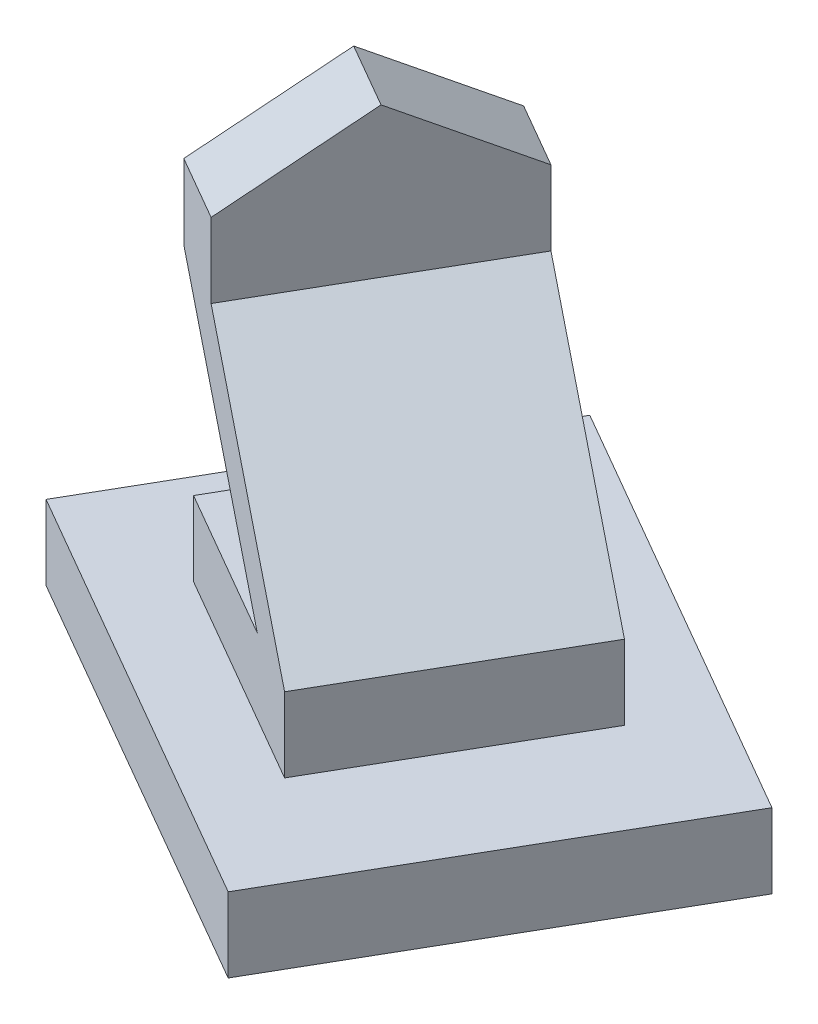
ISO-10303-21;
HEADER;
FILE_DESCRIPTION(('STEP AP214'),'2;1');
FILE_NAME('part.step','',(''),(''),'','','');
FILE_SCHEMA(('AUTOMOTIVE_DESIGN { 1 0 10303 214 1 1 1 1 }'));
ENDSEC;
DATA;
#1=APPLICATION_CONTEXT('core data for automotive mechanical design processes');
#2=APPLICATION_PROTOCOL_DEFINITION('international standard','automotive_design',2000,#1);
#3=PRODUCT_CONTEXT('',#1,'mechanical');
#4=PRODUCT('Part','Part','',(#3));
#5=PRODUCT_RELATED_PRODUCT_CATEGORY('part','',(#4));
#6=PRODUCT_DEFINITION_FORMATION('','',#4);
#7=PRODUCT_DEFINITION_CONTEXT('part definition',#1,'design');
#8=PRODUCT_DEFINITION('design','',#6,#7);
#9=PRODUCT_DEFINITION_SHAPE('','',#8);
#10=(LENGTH_UNIT() NAMED_UNIT(*) SI_UNIT(.MILLI.,.METRE.));
#11=(NAMED_UNIT(*) PLANE_ANGLE_UNIT() SI_UNIT($,.RADIAN.));
#12=(NAMED_UNIT(*) SI_UNIT($,.STERADIAN.) SOLID_ANGLE_UNIT());
#13=UNCERTAINTY_MEASURE_WITH_UNIT(LENGTH_MEASURE(1.E-05),#10,'distance_accuracy_value','');
#14=(GEOMETRIC_REPRESENTATION_CONTEXT(3) GLOBAL_UNCERTAINTY_ASSIGNED_CONTEXT((#13)) GLOBAL_UNIT_ASSIGNED_CONTEXT((#10,
#11,#12)) REPRESENTATION_CONTEXT('',''));
#15=CARTESIAN_POINT('',(0.,0.,0.));
#16=DIRECTION('',(0.,0.,1.));
#17=DIRECTION('',(1.,0.,0.));
#18=AXIS2_PLACEMENT_3D('',#15,#16,#17);
#19=CARTESIAN_POINT('',(-1732.05080756888,300.,-999.999999999994));
#20=DIRECTION('',(0.,-1.,0.));
#21=DIRECTION('',(0.,0.,-1.));
#22=AXIS2_PLACEMENT_3D('',#19,#20,#21);
#23=PLANE('',#22);
#24=DIRECTION('',(0.86602540378444,0.,0.499999999999997));
#25=VECTOR('',#24,1.);
#26=CARTESIAN_POINT('',(-1732.05080756888,300.,-999.999999999994));
#27=LINE('',#26,#25);
#28=CARTESIAN_POINT('',(-1732.05080756888,300.,-999.999999999994));
#29=VERTEX_POINT('',#28);
#30=CARTESIAN_POINT('',(0.,300.,0.));
#31=VERTEX_POINT('',#30);
#32=EDGE_CURVE('E238',#29,#31,#27,.T.);
#33=ORIENTED_EDGE('',*,*,#32,.T.);
#34=DIRECTION('',(0.499999999999998,0.,-0.86602540378444));
#35=VECTOR('',#34,1.);
#36=CARTESIAN_POINT('',(0.,300.,0.));
#37=LINE('',#36,#35);
#38=CARTESIAN_POINT('',(799.999999999996,300.,-1385.6406460551));
#39=VERTEX_POINT('',#38);
#40=EDGE_CURVE('E236',#31,#39,#37,.T.);
#41=ORIENTED_EDGE('',*,*,#40,.T.);
#42=DIRECTION('',(-0.86602540378444,0.,-0.499999999999998));
#43=VECTOR('',#42,1.);
#44=CARTESIAN_POINT('',(799.999999999996,300.,-1385.6406460551));
#45=LINE('',#44,#43);
#46=CARTESIAN_POINT('',(-932.050807568884,300.,-2385.6406460551));
#47=VERTEX_POINT('',#46);
#48=EDGE_CURVE('E234',#39,#47,#45,.T.);
#49=ORIENTED_EDGE('',*,*,#48,.T.);
#50=DIRECTION('',(-0.499999999999997,0.,0.86602540378444));
#51=VECTOR('',#50,1.);
#52=CARTESIAN_POINT('',(-932.050807568884,300.,-2385.6406460551));
#53=LINE('',#52,#51);
#54=EDGE_CURVE('E232',#47,#29,#53,.T.);
#55=ORIENTED_EDGE('',*,*,#54,.T.);
#56=EDGE_LOOP('',(#33,#41,#49,#55));
#57=FACE_BOUND('',#56,.T.);
#58=DIRECTION('',(-0.5,0.,0.866025403784439));
#59=VECTOR('',#58,1.);
#60=CARTESIAN_POINT('',(-1149.03810567667,300.,-1009.80762113533));
#61=LINE('',#60,#59);
#62=CARTESIAN_POINT('',(-649.038105676662,300.,-1875.83302491977));
#63=VERTEX_POINT('',#62);
#64=CARTESIAN_POINT('',(-1149.03810567667,300.,-1009.80762113533));
#65=VERTEX_POINT('',#64);
#66=EDGE_CURVE('E193',#63,#65,#61,.T.);
#67=ORIENTED_EDGE('',*,*,#66,.F.);
#68=DIRECTION('',(-0.866025403784439,0.,-0.499999999999999));
#69=VECTOR('',#68,1.);
#70=CARTESIAN_POINT('',(-649.038105676662,300.,-1875.83302491977));
#71=LINE('',#70,#69);
#72=CARTESIAN_POINT('',(216.987298107781,300.,-1375.83302491977));
#73=VERTEX_POINT('',#72);
#74=EDGE_CURVE('E213',#73,#63,#71,.T.);
#75=ORIENTED_EDGE('',*,*,#74,.F.);
#76=DIRECTION('',(0.499999999999999,0.,-0.866025403784439));
#77=VECTOR('',#76,1.);
#78=CARTESIAN_POINT('',(216.987298107781,300.,-1375.83302491977));
#79=LINE('',#78,#77);
#80=CARTESIAN_POINT('',(-283.012701892222,300.,-509.807621135326));
#81=VERTEX_POINT('',#80);
#82=EDGE_CURVE('E210',#81,#73,#79,.T.);
#83=ORIENTED_EDGE('',*,*,#82,.F.);
#84=DIRECTION('',(0.866025403784439,0.,0.5));
#85=VECTOR('',#84,1.);
#86=CARTESIAN_POINT('',(-283.012701892222,300.,-509.807621135326));
#87=LINE('',#86,#85);
#88=EDGE_CURVE('E59',#65,#81,#87,.T.);
#89=ORIENTED_EDGE('',*,*,#88,.F.);
#90=EDGE_LOOP('',(#67,#75,#83,#89));
#91=FACE_BOUND('',#90,.T.);
#92=ADVANCED_FACE('F34',(#57,#91),#23,.F.);
#93=CARTESIAN_POINT('',(-1732.05080756888,300.,-999.999999999994));
#94=DIRECTION('',(0.499999999999997,0.,-0.86602540378444));
#95=DIRECTION('',(-0.86602540378444,0.,-0.499999999999997));
#96=AXIS2_PLACEMENT_3D('',#93,#94,#95);
#97=PLANE('',#96);
#98=DIRECTION('',(0.86602540378444,0.,0.499999999999997));
#99=VECTOR('',#98,1.);
#100=CARTESIAN_POINT('',(-1732.05080756888,0.,-999.999999999994));
#101=LINE('',#100,#99);
#102=CARTESIAN_POINT('',(-1732.05080756888,0.,-999.999999999994));
#103=VERTEX_POINT('',#102);
#104=CARTESIAN_POINT('',(0.,0.,0.));
#105=VERTEX_POINT('',#104);
#106=EDGE_CURVE('E247',#103,#105,#101,.T.);
#107=ORIENTED_EDGE('',*,*,#106,.T.);
#108=DIRECTION('',(0.,-1.,0.));
#109=VECTOR('',#108,1.);
#110=CARTESIAN_POINT('',(0.,300.,0.));
#111=LINE('',#110,#109);
#112=EDGE_CURVE('E11',#31,#105,#111,.T.);
#113=ORIENTED_EDGE('',*,*,#112,.F.);
#114=ORIENTED_EDGE('',*,*,#32,.F.);
#115=DIRECTION('',(0.,-1.,0.));
#116=VECTOR('',#115,1.);
#117=CARTESIAN_POINT('',(-1732.05080756888,300.,-999.999999999994));
#118=LINE('',#117,#116);
#119=EDGE_CURVE('E229',#29,#103,#118,.T.);
#120=ORIENTED_EDGE('',*,*,#119,.T.);
#121=EDGE_LOOP('',(#107,#113,#114,#120));
#122=FACE_BOUND('',#121,.T.);
#123=ADVANCED_FACE('F36',(#122),#97,.F.);
#124=CARTESIAN_POINT('',(0.,300.,0.));
#125=DIRECTION('',(-0.86602540378444,0.,-0.499999999999998));
#126=DIRECTION('',(-0.499999999999998,0.,0.86602540378444));
#127=AXIS2_PLACEMENT_3D('',#124,#125,#126);
#128=PLANE('',#127);
#129=DIRECTION('',(0.499999999999998,0.,-0.86602540378444));
#130=VECTOR('',#129,1.);
#131=CARTESIAN_POINT('',(0.,0.,0.));
#132=LINE('',#131,#130);
#133=CARTESIAN_POINT('',(799.999999999996,0.,-1385.6406460551));
#134=VERTEX_POINT('',#133);
#135=EDGE_CURVE('E245',#105,#134,#132,.T.);
#136=ORIENTED_EDGE('',*,*,#135,.T.);
#137=DIRECTION('',(0.,-1.,0.));
#138=VECTOR('',#137,1.);
#139=CARTESIAN_POINT('',(799.999999999996,300.,-1385.6406460551));
#140=LINE('',#139,#138);
#141=EDGE_CURVE('E43',#39,#134,#140,.T.);
#142=ORIENTED_EDGE('',*,*,#141,.F.);
#143=ORIENTED_EDGE('',*,*,#40,.F.);
#144=ORIENTED_EDGE('',*,*,#112,.T.);
#145=EDGE_LOOP('',(#136,#142,#143,#144));
#146=FACE_BOUND('',#145,.T.);
#147=ADVANCED_FACE('F294',(#146),#128,.F.);
#148=CARTESIAN_POINT('',(799.999999999996,300.,-1385.6406460551));
#149=DIRECTION('',(-0.499999999999998,0.,0.86602540378444));
#150=DIRECTION('',(0.86602540378444,0.,0.499999999999998));
#151=AXIS2_PLACEMENT_3D('',#148,#149,#150);
#152=PLANE('',#151);
#153=DIRECTION('',(-0.86602540378444,0.,-0.499999999999998));
#154=VECTOR('',#153,1.);
#155=CARTESIAN_POINT('',(799.999999999996,0.,-1385.6406460551));
#156=LINE('',#155,#154);
#157=CARTESIAN_POINT('',(-932.050807568884,0.,-2385.6406460551));
#158=VERTEX_POINT('',#157);
#159=EDGE_CURVE('E243',#134,#158,#156,.T.);
#160=ORIENTED_EDGE('',*,*,#159,.T.);
#161=DIRECTION('',(0.,-1.,0.));
#162=VECTOR('',#161,1.);
#163=CARTESIAN_POINT('',(-932.050807568884,300.,-2385.6406460551));
#164=LINE('',#163,#162);
#165=EDGE_CURVE('E226',#47,#158,#164,.T.);
#166=ORIENTED_EDGE('',*,*,#165,.F.);
#167=ORIENTED_EDGE('',*,*,#48,.F.);
#168=ORIENTED_EDGE('',*,*,#141,.T.);
#169=EDGE_LOOP('',(#160,#166,#167,#168));
#170=FACE_BOUND('',#169,.T.);
#171=ADVANCED_FACE('F303',(#170),#152,.F.);
#172=CARTESIAN_POINT('',(-932.050807568884,300.,-2385.6406460551));
#173=DIRECTION('',(0.86602540378444,0.,0.499999999999997));
#174=DIRECTION('',(0.499999999999997,0.,-0.86602540378444));
#175=AXIS2_PLACEMENT_3D('',#172,#173,#174);
#176=PLANE('',#175);
#177=DIRECTION('',(-0.499999999999997,0.,0.86602540378444));
#178=VECTOR('',#177,1.);
#179=CARTESIAN_POINT('',(-932.050807568884,0.,-2385.6406460551));
#180=LINE('',#179,#178);
#181=EDGE_CURVE('E241',#158,#103,#180,.T.);
#182=ORIENTED_EDGE('',*,*,#181,.T.);
#183=ORIENTED_EDGE('',*,*,#119,.F.);
#184=ORIENTED_EDGE('',*,*,#54,.F.);
#185=ORIENTED_EDGE('',*,*,#165,.T.);
#186=EDGE_LOOP('',(#182,#183,#184,#185));
#187=FACE_BOUND('',#186,.T.);
#188=ADVANCED_FACE('F300',(#187),#176,.F.);
#189=CARTESIAN_POINT('',(-1732.05080756888,0.,-999.999999999994));
#190=DIRECTION('',(0.,-1.,0.));
#191=DIRECTION('',(0.,0.,-1.));
#192=AXIS2_PLACEMENT_3D('',#189,#190,#191);
#193=PLANE('',#192);
#194=ORIENTED_EDGE('',*,*,#106,.F.);
#195=ORIENTED_EDGE('',*,*,#181,.F.);
#196=ORIENTED_EDGE('',*,*,#159,.F.);
#197=ORIENTED_EDGE('',*,*,#135,.F.);
#198=EDGE_LOOP('',(#194,#195,#196,#197));
#199=FACE_BOUND('',#198,.T.);
#200=ADVANCED_FACE('F298',(#199),#193,.T.);
#201=CARTESIAN_POINT('',(-1149.03810567667,600.,-1009.80762113533));
#202=DIRECTION('',(0.866025403784439,0.,0.5));
#203=DIRECTION('',(0.5,0.,-0.866025403784439));
#204=AXIS2_PLACEMENT_3D('',#201,#202,#203);
#205=PLANE('',#204);
#206=ORIENTED_EDGE('',*,*,#66,.T.);
#207=DIRECTION('',(0.,-1.,0.));
#208=VECTOR('',#207,1.);
#209=CARTESIAN_POINT('',(-1149.03810567667,600.,-1009.80762113533));
#210=LINE('',#209,#208);
#211=CARTESIAN_POINT('',(-1149.03810567667,600.,-1009.80762113533));
#212=VERTEX_POINT('',#211);
#213=EDGE_CURVE('E250',#212,#65,#210,.T.);
#214=ORIENTED_EDGE('',*,*,#213,.F.);
#215=DIRECTION('',(-0.5,0.,0.866025403784439));
#216=VECTOR('',#215,1.);
#217=CARTESIAN_POINT('',(-1149.03810567667,600.,-1009.80762113533));
#218=LINE('',#217,#216);
#219=CARTESIAN_POINT('',(-649.038105676662,600.,-1875.83302491977));
#220=VERTEX_POINT('',#219);
#221=EDGE_CURVE('E216',#220,#212,#218,.T.);
#222=ORIENTED_EDGE('',*,*,#221,.F.);
#223=DIRECTION('',(0.,-1.,0.));
#224=VECTOR('',#223,1.);
#225=CARTESIAN_POINT('',(-649.038105676662,600.,-1875.83302491977));
#226=LINE('',#225,#224);
#227=EDGE_CURVE('E258',#220,#63,#226,.T.);
#228=ORIENTED_EDGE('',*,*,#227,.T.);
#229=EDGE_LOOP('',(#206,#214,#222,#228));
#230=FACE_BOUND('',#229,.T.);
#231=ADVANCED_FACE('F323',(#230),#205,.F.);
#232=CARTESIAN_POINT('',(-283.012701892222,600.,-509.807621135326));
#233=DIRECTION('',(0.5,0.,-0.866025403784439));
#234=DIRECTION('',(-0.866025403784439,0.,-0.5));
#235=AXIS2_PLACEMENT_3D('',#232,#233,#234);
#236=PLANE('',#235);
#237=ORIENTED_EDGE('',*,*,#88,.T.);
#238=DIRECTION('',(0.,-1.,0.));
#239=VECTOR('',#238,1.);
#240=CARTESIAN_POINT('',(-283.012701892222,600.,-509.807621135326));
#241=LINE('',#240,#239);
#242=CARTESIAN_POINT('',(-283.012701892222,600.,-509.807621135326));
#243=VERTEX_POINT('',#242);
#244=EDGE_CURVE('E252',#243,#81,#241,.T.);
#245=ORIENTED_EDGE('',*,*,#244,.F.);
#246=DIRECTION('',(-0.615137367081816,0.703899632636785,-0.355149724473284));
#247=VECTOR('',#246,1.);
#248=CARTESIAN_POINT('',(-283.012701892222,600.,-509.807621135326));
#249=LINE('',#248,#247);
#250=CARTESIAN_POINT('',(-982.132108762809,1400.,-913.44439888775));
#251=VERTEX_POINT('',#250);
#252=EDGE_CURVE('E148',#243,#251,#249,.T.);
#253=ORIENTED_EDGE('',*,*,#252,.T.);
#254=DIRECTION('',(0.,1.,0.));
#255=VECTOR('',#254,1.);
#256=CARTESIAN_POINT('',(-982.132108762809,1400.,-913.44439888775));
#257=LINE('',#256,#255);
#258=CARTESIAN_POINT('',(-982.132108762809,1700.,-913.44439888775));
#259=VERTEX_POINT('',#258);
#260=EDGE_CURVE('E169',#251,#259,#257,.T.);
#261=ORIENTED_EDGE('',*,*,#260,.T.);
#262=DIRECTION('',(-0.866025403784439,0.,-0.499999999999999));
#263=VECTOR('',#262,1.);
#264=CARTESIAN_POINT('',(-982.132108762809,1700.,-913.44439888775));
#265=LINE('',#264,#263);
#266=CARTESIAN_POINT('',(-1241.93972989814,1700.,-1063.44439888775));
#267=VERTEX_POINT('',#266);
#268=EDGE_CURVE('E154',#259,#267,#265,.T.);
#269=ORIENTED_EDGE('',*,*,#268,.T.);
#270=DIRECTION('',(0.,-1.,0.));
#271=VECTOR('',#270,1.);
#272=CARTESIAN_POINT('',(-1241.93972989814,1700.,-1063.44439888775));
#273=LINE('',#272,#271);
#274=CARTESIAN_POINT('',(-1241.93972989814,1400.,-1063.44439888775));
#275=VERTEX_POINT('',#274);
#276=EDGE_CURVE('E172',#267,#275,#273,.T.);
#277=ORIENTED_EDGE('',*,*,#276,.T.);
#278=DIRECTION('',(0.615137367081816,-0.703899632636785,0.355149724473284));
#279=VECTOR('',#278,1.);
#280=CARTESIAN_POINT('',(-1241.93972989814,1400.,-1063.44439888775));
#281=LINE('',#280,#279);
#282=CARTESIAN_POINT('',(-542.820323027554,600.,-659.807621135326));
#283=VERTEX_POINT('',#282);
#284=EDGE_CURVE('E175',#275,#283,#281,.T.);
#285=ORIENTED_EDGE('',*,*,#284,.T.);
#286=DIRECTION('',(0.866025403784439,0.,0.5));
#287=VECTOR('',#286,1.);
#288=CARTESIAN_POINT('',(-283.012701892222,600.,-509.807621135326));
#289=LINE('',#288,#287);
#290=EDGE_CURVE('E219',#212,#283,#289,.T.);
#291=ORIENTED_EDGE('',*,*,#290,.F.);
#292=ORIENTED_EDGE('',*,*,#213,.T.);
#293=EDGE_LOOP('',(#237,#245,#253,#261,#269,#277,#285,#291,#292));
#294=FACE_BOUND('',#293,.T.);
#295=ADVANCED_FACE('F276',(#294),#236,.F.);
#296=CARTESIAN_POINT('',(216.987298107781,600.,-1375.83302491977));
#297=DIRECTION('',(-0.866025403784439,0.,-0.499999999999999));
#298=DIRECTION('',(-0.499999999999999,0.,0.866025403784439));
#299=AXIS2_PLACEMENT_3D('',#296,#297,#298);
#300=PLANE('',#299);
#301=ORIENTED_EDGE('',*,*,#82,.T.);
#302=DIRECTION('',(0.,-1.,0.));
#303=VECTOR('',#302,1.);
#304=CARTESIAN_POINT('',(216.987298107781,600.,-1375.83302491977));
#305=LINE('',#304,#303);
#306=CARTESIAN_POINT('',(216.987298107781,600.,-1375.83302491977));
#307=VERTEX_POINT('',#306);
#308=EDGE_CURVE('E255',#307,#73,#305,.T.);
#309=ORIENTED_EDGE('',*,*,#308,.F.);
#310=DIRECTION('',(0.499999999999999,0.,-0.866025403784439));
#311=VECTOR('',#310,1.);
#312=CARTESIAN_POINT('',(216.987298107781,600.,-1375.83302491977));
#313=LINE('',#312,#311);
#314=EDGE_CURVE('E222',#243,#307,#313,.T.);
#315=ORIENTED_EDGE('',*,*,#314,.F.);
#316=ORIENTED_EDGE('',*,*,#244,.T.);
#317=EDGE_LOOP('',(#301,#309,#315,#316));
#318=FACE_BOUND('',#317,.T.);
#319=ADVANCED_FACE('F330',(#318),#300,.F.);
#320=CARTESIAN_POINT('',(-649.038105676662,600.,-1875.83302491977));
#321=DIRECTION('',(-0.499999999999999,0.,0.866025403784439));
#322=DIRECTION('',(0.866025403784439,0.,0.499999999999999));
#323=AXIS2_PLACEMENT_3D('',#320,#321,#322);
#324=PLANE('',#323);
#325=ORIENTED_EDGE('',*,*,#74,.T.);
#326=ORIENTED_EDGE('',*,*,#227,.F.);
#327=DIRECTION('',(-0.866025403784439,0.,-0.499999999999999));
#328=VECTOR('',#327,1.);
#329=CARTESIAN_POINT('',(-649.038105676662,600.,-1875.83302491977));
#330=LINE('',#329,#328);
#331=CARTESIAN_POINT('',(-42.8203230275505,600.,-1525.83302491977));
#332=VERTEX_POINT('',#331);
#333=EDGE_CURVE('E194',#332,#220,#330,.T.);
#334=ORIENTED_EDGE('',*,*,#333,.F.);
#335=DIRECTION('',(0.615137367081816,-0.703899632636785,0.355149724473284));
#336=VECTOR('',#335,1.);
#337=CARTESIAN_POINT('',(-741.939729898141,1400.,-1929.46980267219));
#338=LINE('',#337,#336);
#339=CARTESIAN_POINT('',(-741.939729898141,1400.,-1929.46980267219));
#340=VERTEX_POINT('',#339);
#341=EDGE_CURVE('E185',#340,#332,#338,.T.);
#342=ORIENTED_EDGE('',*,*,#341,.F.);
#343=DIRECTION('',(0.,-1.,0.));
#344=VECTOR('',#343,1.);
#345=CARTESIAN_POINT('',(-741.939729898141,1700.,-1929.46980267219));
#346=LINE('',#345,#344);
#347=CARTESIAN_POINT('',(-741.939729898141,1700.,-1929.46980267219));
#348=VERTEX_POINT('',#347);
#349=EDGE_CURVE('E182',#348,#340,#346,.T.);
#350=ORIENTED_EDGE('',*,*,#349,.F.);
#351=DIRECTION('',(-0.866025403784439,0.,-0.499999999999999));
#352=VECTOR('',#351,1.);
#353=CARTESIAN_POINT('',(-482.132108762809,1700.,-1779.46980267219));
#354=LINE('',#353,#352);
#355=CARTESIAN_POINT('',(-482.132108762809,1700.,-1779.46980267219));
#356=VERTEX_POINT('',#355);
#357=EDGE_CURVE('E180',#356,#348,#354,.T.);
#358=ORIENTED_EDGE('',*,*,#357,.F.);
#359=DIRECTION('',(0.,1.,0.));
#360=VECTOR('',#359,1.);
#361=CARTESIAN_POINT('',(-482.132108762809,1400.,-1779.46980267219));
#362=LINE('',#361,#360);
#363=CARTESIAN_POINT('',(-482.132108762809,1400.,-1779.46980267219));
#364=VERTEX_POINT('',#363);
#365=EDGE_CURVE('E161',#364,#356,#362,.T.);
#366=ORIENTED_EDGE('',*,*,#365,.F.);
#367=DIRECTION('',(-0.615137367081816,0.703899632636785,-0.355149724473284));
#368=VECTOR('',#367,1.);
#369=CARTESIAN_POINT('',(216.987298107778,600.,-1375.83302491976));
#370=LINE('',#369,#368);
#371=EDGE_CURVE('E176',#307,#364,#370,.T.);
#372=ORIENTED_EDGE('',*,*,#371,.F.);
#373=ORIENTED_EDGE('',*,*,#308,.T.);
#374=EDGE_LOOP('',(#325,#326,#334,#342,#350,#358,#366,#372,#373));
#375=FACE_BOUND('',#374,.T.);
#376=ADVANCED_FACE('F270',(#375),#324,.F.);
#377=CARTESIAN_POINT('',(-1149.03810567667,600.,-1009.80762113533));
#378=DIRECTION('',(0.,1.,0.));
#379=DIRECTION('',(0.,0.,1.));
#380=AXIS2_PLACEMENT_3D('',#377,#378,#379);
#381=PLANE('',#380);
#382=DIRECTION('',(-0.5,0.,0.866025403784439));
#383=VECTOR('',#382,1.);
#384=CARTESIAN_POINT('',(-42.8203230275537,600.,-1525.83302491976));
#385=LINE('',#384,#383);
#386=EDGE_CURVE('E51',#332,#283,#385,.T.);
#387=ORIENTED_EDGE('',*,*,#386,.F.);
#388=ORIENTED_EDGE('',*,*,#333,.T.);
#389=ORIENTED_EDGE('',*,*,#221,.T.);
#390=ORIENTED_EDGE('',*,*,#290,.T.);
#391=EDGE_LOOP('',(#387,#388,#389,#390));
#392=FACE_BOUND('',#391,.T.);
#393=ADVANCED_FACE('F279',(#392),#381,.T.);
#394=CARTESIAN_POINT('',(-741.939729898141,1400.,-1929.46980267219));
#395=DIRECTION('',(-0.60959496357799,-0.710299448946569,-0.351949816318392));
#396=DIRECTION('',(0.758851633213317,-0.651263540181302,0.));
#397=AXIS2_PLACEMENT_3D('',#394,#395,#396);
#398=PLANE('',#397);
#399=ORIENTED_EDGE('',*,*,#284,.F.);
#400=DIRECTION('',(-0.5,0.,0.866025403784439));
#401=VECTOR('',#400,1.);
#402=CARTESIAN_POINT('',(-741.939729898141,1400.,-1929.46980267219));
#403=LINE('',#402,#401);
#404=EDGE_CURVE('E188',#340,#275,#403,.T.);
#405=ORIENTED_EDGE('',*,*,#404,.F.);
#406=ORIENTED_EDGE('',*,*,#341,.T.);
#407=ORIENTED_EDGE('',*,*,#386,.T.);
#408=EDGE_LOOP('',(#399,#405,#406,#407));
#409=FACE_BOUND('',#408,.T.);
#410=ADVANCED_FACE('F277',(#409),#398,.T.);
#411=CARTESIAN_POINT('',(-741.939729898141,1700.,-1929.46980267219));
#412=DIRECTION('',(-0.866025403784439,0.,-0.5));
#413=DIRECTION('',(-0.5,0.,0.866025403784439));
#414=AXIS2_PLACEMENT_3D('',#411,#412,#413);
#415=PLANE('',#414);
#416=ORIENTED_EDGE('',*,*,#276,.F.);
#417=DIRECTION('',(-0.428746462856272,-0.514495755427526,0.742610657232506));
#418=VECTOR('',#417,1.);
#419=CARTESIAN_POINT('',(-991.93972989814,2000.,-1496.45710077997));
#420=LINE('',#419,#418);
#421=CARTESIAN_POINT('',(-991.93972989814,2000.,-1496.45710077997));
#422=VERTEX_POINT('',#421);
#423=EDGE_CURVE('E162',#422,#267,#420,.T.);
#424=ORIENTED_EDGE('',*,*,#423,.F.);
#425=DIRECTION('',(-0.428746462856272,0.514495755427526,0.742610657232506));
#426=VECTOR('',#425,1.);
#427=CARTESIAN_POINT('',(-741.939729898141,1700.,-1929.46980267219));
#428=LINE('',#427,#426);
#429=EDGE_CURVE('E144',#348,#422,#428,.T.);
#430=ORIENTED_EDGE('',*,*,#429,.F.);
#431=ORIENTED_EDGE('',*,*,#349,.T.);
#432=ORIENTED_EDGE('',*,*,#404,.T.);
#433=EDGE_LOOP('',(#416,#424,#430,#431,#432));
#434=FACE_BOUND('',#433,.T.);
#435=ADVANCED_FACE('F273',(#434),#415,.T.);
#436=CARTESIAN_POINT('',(-482.132108762809,1400.,-1779.46980267219));
#437=DIRECTION('',(0.866025403784439,0.,0.5));
#438=DIRECTION('',(0.5,0.,-0.866025403784439));
#439=AXIS2_PLACEMENT_3D('',#436,#437,#438);
#440=PLANE('',#439);
#441=ORIENTED_EDGE('',*,*,#260,.F.);
#442=DIRECTION('',(-0.5,0.,0.866025403784439));
#443=VECTOR('',#442,1.);
#444=CARTESIAN_POINT('',(-482.132108762809,1400.,-1779.46980267219));
#445=LINE('',#444,#443);
#446=EDGE_CURVE('E201',#364,#251,#445,.T.);
#447=ORIENTED_EDGE('',*,*,#446,.F.);
#448=ORIENTED_EDGE('',*,*,#365,.T.);
#449=DIRECTION('',(-0.428746462856272,0.514495755427526,0.742610657232506));
#450=VECTOR('',#449,1.);
#451=CARTESIAN_POINT('',(-482.132108762809,1700.,-1779.46980267219));
#452=LINE('',#451,#450);
#453=CARTESIAN_POINT('',(-732.132108762809,2000.,-1346.45710077997));
#454=VERTEX_POINT('',#453);
#455=EDGE_CURVE('E142',#356,#454,#452,.T.);
#456=ORIENTED_EDGE('',*,*,#455,.T.);
#457=DIRECTION('',(-0.428746462856272,-0.514495755427526,0.742610657232506));
#458=VECTOR('',#457,1.);
#459=CARTESIAN_POINT('',(-732.132108762809,2000.,-1346.45710077997));
#460=LINE('',#459,#458);
#461=EDGE_CURVE('E152',#454,#259,#460,.T.);
#462=ORIENTED_EDGE('',*,*,#461,.T.);
#463=EDGE_LOOP('',(#441,#447,#448,#456,#462));
#464=FACE_BOUND('',#463,.T.);
#465=ADVANCED_FACE('F159',(#464),#440,.T.);
#466=CARTESIAN_POINT('',(216.987298107778,600.,-1375.83302491976));
#467=DIRECTION('',(0.60959496357799,0.710299448946569,0.351949816318392));
#468=DIRECTION('',(-0.758851633213317,0.651263540181301,0.));
#469=AXIS2_PLACEMENT_3D('',#466,#467,#468);
#470=PLANE('',#469);
#471=ORIENTED_EDGE('',*,*,#252,.F.);
#472=ORIENTED_EDGE('',*,*,#314,.T.);
#473=ORIENTED_EDGE('',*,*,#371,.T.);
#474=ORIENTED_EDGE('',*,*,#446,.T.);
#475=EDGE_LOOP('',(#471,#472,#473,#474));
#476=FACE_BOUND('',#475,.T.);
#477=ADVANCED_FACE('F267',(#476),#470,.T.);
#478=CARTESIAN_POINT('',(-991.93972989814,2000.,-1496.45710077997));
#479=DIRECTION('',(-0.257247877713763,0.857492925712544,0.445566394339503));
#480=DIRECTION('',(0.,-0.461083967620704,0.887356509416114));
#481=AXIS2_PLACEMENT_3D('',#478,#479,#480);
#482=PLANE('',#481);
#483=ORIENTED_EDGE('',*,*,#461,.F.);
#484=DIRECTION('',(0.866025403784439,0.,0.5));
#485=VECTOR('',#484,1.);
#486=CARTESIAN_POINT('',(-991.93972989814,2000.,-1496.45710077997));
#487=LINE('',#486,#485);
#488=EDGE_CURVE('E137',#422,#454,#487,.T.);
#489=ORIENTED_EDGE('',*,*,#488,.F.);
#490=ORIENTED_EDGE('',*,*,#423,.T.);
#491=ORIENTED_EDGE('',*,*,#268,.F.);
#492=EDGE_LOOP('',(#483,#489,#490,#491));
#493=FACE_BOUND('',#492,.T.);
#494=ADVANCED_FACE('F153',(#493),#482,.T.);
#495=CARTESIAN_POINT('',(-741.939729898141,1700.,-1929.46980267219));
#496=DIRECTION('',(0.257247877713763,0.857492925712544,-0.445566394339503));
#497=DIRECTION('',(0.,0.461083967620704,0.887356509416114));
#498=AXIS2_PLACEMENT_3D('',#495,#496,#497);
#499=PLANE('',#498);
#500=ORIENTED_EDGE('',*,*,#455,.F.);
#501=ORIENTED_EDGE('',*,*,#357,.T.);
#502=ORIENTED_EDGE('',*,*,#429,.T.);
#503=ORIENTED_EDGE('',*,*,#488,.T.);
#504=EDGE_LOOP('',(#500,#501,#502,#503));
#505=FACE_BOUND('',#504,.T.);
#506=ADVANCED_FACE('F139',(#505),#499,.T.);
#507=CLOSED_SHELL('',(#92,#123,#147,#171,#188,#200,#231,#295,#319,#376,#393,#410,#435,#465,#477,
#494,#506));
#508=MANIFOLD_SOLID_BREP('B2',#507);
#509=ADVANCED_BREP_SHAPE_REPRESENTATION('',(#18,#508),#14);
#510=SHAPE_DEFINITION_REPRESENTATION(#9,#509);
ENDSEC;
END-ISO-10303-21;
